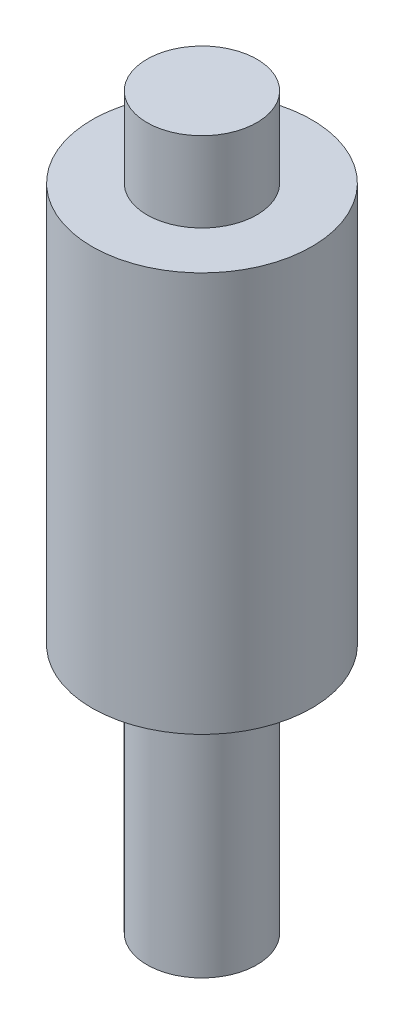
ISO-10303-21;
HEADER;
FILE_DESCRIPTION(('STEP AP214'),'2;1');
FILE_NAME('part.step','',(''),(''),'','','');
FILE_SCHEMA(('AUTOMOTIVE_DESIGN { 1 0 10303 214 1 1 1 1 }'));
ENDSEC;
DATA;
#1=APPLICATION_CONTEXT('core data for automotive mechanical design processes');
#2=APPLICATION_PROTOCOL_DEFINITION('international standard','automotive_design',2000,#1);
#3=PRODUCT_CONTEXT('',#1,'mechanical');
#4=PRODUCT('Part','Part','',(#3));
#5=PRODUCT_RELATED_PRODUCT_CATEGORY('part','',(#4));
#6=PRODUCT_DEFINITION_FORMATION('','',#4);
#7=PRODUCT_DEFINITION_CONTEXT('part definition',#1,'design');
#8=PRODUCT_DEFINITION('design','',#6,#7);
#9=PRODUCT_DEFINITION_SHAPE('','',#8);
#10=(LENGTH_UNIT() NAMED_UNIT(*) SI_UNIT(.MILLI.,.METRE.));
#11=(NAMED_UNIT(*) PLANE_ANGLE_UNIT() SI_UNIT($,.RADIAN.));
#12=(NAMED_UNIT(*) SI_UNIT($,.STERADIAN.) SOLID_ANGLE_UNIT());
#13=UNCERTAINTY_MEASURE_WITH_UNIT(LENGTH_MEASURE(1.E-05),#10,'distance_accuracy_value','');
#14=(GEOMETRIC_REPRESENTATION_CONTEXT(3) GLOBAL_UNCERTAINTY_ASSIGNED_CONTEXT((#13)) GLOBAL_UNIT_ASSIGNED_CONTEXT((#10,
#11,#12)) REPRESENTATION_CONTEXT('',''));
#15=CARTESIAN_POINT('',(0.,0.,0.));
#16=DIRECTION('',(0.,0.,1.));
#17=DIRECTION('',(1.,0.,0.));
#18=AXIS2_PLACEMENT_3D('',#15,#16,#17);
#19=CARTESIAN_POINT('',(0.,8.,0.));
#20=DIRECTION('',(0.,-1.,0.));
#21=DIRECTION('',(0.,0.,-1.));
#22=AXIS2_PLACEMENT_3D('',#19,#20,#21);
#23=CYLINDRICAL_SURFACE('',#22,2.2);
#24=CARTESIAN_POINT('',(0.,8.,0.));
#25=DIRECTION('',(0.,1.,0.));
#26=DIRECTION('',(0.,0.,1.));
#27=AXIS2_PLACEMENT_3D('',#24,#25,#26);
#28=CIRCLE('',#27,2.2);
#29=CARTESIAN_POINT('',(0.,8.,2.2));
#30=VERTEX_POINT('',#29);
#31=EDGE_CURVE('E42',#30,#30,#28,.T.);
#32=ORIENTED_EDGE('',*,*,#31,.F.);
#33=EDGE_LOOP('',(#32));
#34=FACE_BOUND('',#33,.T.);
#35=CARTESIAN_POINT('',(0.,0.,0.));
#36=DIRECTION('',(0.,1.,0.));
#37=DIRECTION('',(0.,0.,1.));
#38=AXIS2_PLACEMENT_3D('',#35,#36,#37);
#39=CIRCLE('',#38,2.2);
#40=CARTESIAN_POINT('',(0.,0.,2.2));
#41=VERTEX_POINT('',#40);
#42=EDGE_CURVE('E33',#41,#41,#39,.T.);
#43=ORIENTED_EDGE('',*,*,#42,.T.);
#44=EDGE_LOOP('',(#43));
#45=FACE_BOUND('',#44,.T.);
#46=ADVANCED_FACE('F30',(#34,#45),#23,.T.);
#47=CARTESIAN_POINT('',(0.,8.,0.));
#48=DIRECTION('',(0.,1.,0.));
#49=DIRECTION('',(0.,0.,1.));
#50=AXIS2_PLACEMENT_3D('',#47,#48,#49);
#51=PLANE('',#50);
#52=CARTESIAN_POINT('',(0.,8.,0.));
#53=DIRECTION('',(0.,1.,0.));
#54=DIRECTION('',(0.,0.,1.));
#55=AXIS2_PLACEMENT_3D('',#52,#53,#54);
#56=CIRCLE('',#55,1.1);
#57=CARTESIAN_POINT('',(0.,8.,1.1));
#58=VERTEX_POINT('',#57);
#59=EDGE_CURVE('E37',#58,#58,#56,.T.);
#60=ORIENTED_EDGE('',*,*,#59,.F.);
#61=EDGE_LOOP('',(#60));
#62=FACE_BOUND('',#61,.T.);
#63=ORIENTED_EDGE('',*,*,#31,.T.);
#64=EDGE_LOOP('',(#63));
#65=FACE_BOUND('',#64,.T.);
#66=ADVANCED_FACE('F59',(#62,#65),#51,.T.);
#67=CARTESIAN_POINT('',(0.,0.,0.));
#68=DIRECTION('',(0.,1.,0.));
#69=DIRECTION('',(0.,0.,1.));
#70=AXIS2_PLACEMENT_3D('',#67,#68,#69);
#71=PLANE('',#70);
#72=CARTESIAN_POINT('',(0.,0.,0.));
#73=DIRECTION('',(0.,-1.,0.));
#74=DIRECTION('',(0.,0.,-1.));
#75=AXIS2_PLACEMENT_3D('',#72,#73,#74);
#76=CIRCLE('',#75,1.1);
#77=CARTESIAN_POINT('',(0.,0.,-1.1));
#78=VERTEX_POINT('',#77);
#79=EDGE_CURVE('E10',#78,#78,#76,.T.);
#80=ORIENTED_EDGE('',*,*,#79,.F.);
#81=EDGE_LOOP('',(#80));
#82=FACE_BOUND('',#81,.T.);
#83=ORIENTED_EDGE('',*,*,#42,.F.);
#84=EDGE_LOOP('',(#83));
#85=FACE_BOUND('',#84,.T.);
#86=ADVANCED_FACE('F56',(#82,#85),#71,.F.);
#87=CARTESIAN_POINT('',(0.,9.6,0.));
#88=DIRECTION('',(0.,-1.,0.));
#89=DIRECTION('',(0.,0.,-1.));
#90=AXIS2_PLACEMENT_3D('',#87,#88,#89);
#91=CYLINDRICAL_SURFACE('',#90,1.1);
#92=CARTESIAN_POINT('',(0.,9.6,0.));
#93=DIRECTION('',(0.,1.,0.));
#94=DIRECTION('',(0.,0.,1.));
#95=AXIS2_PLACEMENT_3D('',#92,#93,#94);
#96=CIRCLE('',#95,1.1);
#97=CARTESIAN_POINT('',(0.,9.6,1.1));
#98=VERTEX_POINT('',#97);
#99=EDGE_CURVE('E47',#98,#98,#96,.T.);
#100=ORIENTED_EDGE('',*,*,#99,.F.);
#101=EDGE_LOOP('',(#100));
#102=FACE_BOUND('',#101,.T.);
#103=ORIENTED_EDGE('',*,*,#59,.T.);
#104=EDGE_LOOP('',(#103));
#105=FACE_BOUND('',#104,.T.);
#106=ADVANCED_FACE('F58',(#102,#105),#91,.T.);
#107=CARTESIAN_POINT('',(0.,9.6,0.));
#108=DIRECTION('',(0.,1.,0.));
#109=DIRECTION('',(0.,0.,1.));
#110=AXIS2_PLACEMENT_3D('',#107,#108,#109);
#111=PLANE('',#110);
#112=ORIENTED_EDGE('',*,*,#99,.T.);
#113=EDGE_LOOP('',(#112));
#114=FACE_BOUND('',#113,.T.);
#115=ADVANCED_FACE('F65',(#114),#111,.T.);
#116=CARTESIAN_POINT('',(0.,-5.,0.));
#117=DIRECTION('',(0.,1.,0.));
#118=DIRECTION('',(0.,0.,1.));
#119=AXIS2_PLACEMENT_3D('',#116,#117,#118);
#120=CYLINDRICAL_SURFACE('',#119,1.1);
#121=CARTESIAN_POINT('',(0.,-5.,0.));
#122=DIRECTION('',(0.,-1.,0.));
#123=DIRECTION('',(0.,0.,-1.));
#124=AXIS2_PLACEMENT_3D('',#121,#122,#123);
#125=CIRCLE('',#124,1.1);
#126=CARTESIAN_POINT('',(0.,-5.,-1.1));
#127=VERTEX_POINT('',#126);
#128=EDGE_CURVE('E46',#127,#127,#125,.T.);
#129=ORIENTED_EDGE('',*,*,#128,.F.);
#130=EDGE_LOOP('',(#129));
#131=FACE_BOUND('',#130,.T.);
#132=ORIENTED_EDGE('',*,*,#79,.T.);
#133=EDGE_LOOP('',(#132));
#134=FACE_BOUND('',#133,.T.);
#135=ADVANCED_FACE('F93',(#131,#134),#120,.T.);
#136=CARTESIAN_POINT('',(0.,-5.,0.));
#137=DIRECTION('',(0.,-1.,0.));
#138=DIRECTION('',(0.,0.,-1.));
#139=AXIS2_PLACEMENT_3D('',#136,#137,#138);
#140=PLANE('',#139);
#141=ORIENTED_EDGE('',*,*,#128,.T.);
#142=EDGE_LOOP('',(#141));
#143=FACE_BOUND('',#142,.T.);
#144=ADVANCED_FACE('F107',(#143),#140,.T.);
#145=CLOSED_SHELL('',(#46,#66,#86,#106,#115,#135,#144));
#146=MANIFOLD_SOLID_BREP('B2',#145);
#147=ADVANCED_BREP_SHAPE_REPRESENTATION('',(#18,#146),#14);
#148=SHAPE_DEFINITION_REPRESENTATION(#9,#147);
ENDSEC;
END-ISO-10303-21;
